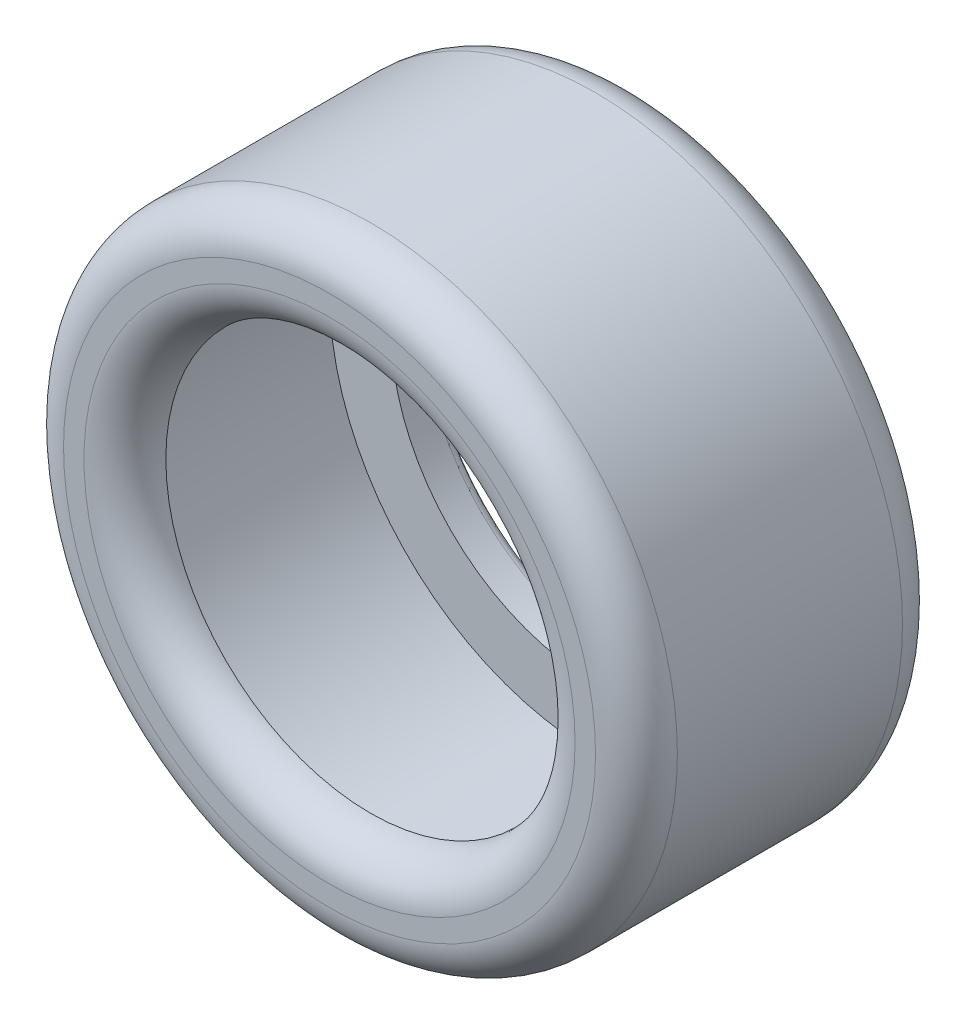
ISO-10303-21;
HEADER;
FILE_DESCRIPTION(('STEP AP214'),'2;1');
FILE_NAME('part.step','',(''),(''),'','','');
FILE_SCHEMA(('AUTOMOTIVE_DESIGN { 1 0 10303 214 1 1 1 1 }'));
ENDSEC;
DATA;
#1=APPLICATION_CONTEXT('core data for automotive mechanical design processes');
#2=APPLICATION_PROTOCOL_DEFINITION('international standard','automotive_design',2000,#1);
#3=PRODUCT_CONTEXT('',#1,'mechanical');
#4=PRODUCT('Part','Part','',(#3));
#5=PRODUCT_RELATED_PRODUCT_CATEGORY('part','',(#4));
#6=PRODUCT_DEFINITION_FORMATION('','',#4);
#7=PRODUCT_DEFINITION_CONTEXT('part definition',#1,'design');
#8=PRODUCT_DEFINITION('design','',#6,#7);
#9=PRODUCT_DEFINITION_SHAPE('','',#8);
#10=(LENGTH_UNIT() NAMED_UNIT(*) SI_UNIT(.MILLI.,.METRE.));
#11=(NAMED_UNIT(*) PLANE_ANGLE_UNIT() SI_UNIT($,.RADIAN.));
#12=(NAMED_UNIT(*) SI_UNIT($,.STERADIAN.) SOLID_ANGLE_UNIT());
#13=UNCERTAINTY_MEASURE_WITH_UNIT(LENGTH_MEASURE(1.E-05),#10,'distance_accuracy_value','');
#14=(GEOMETRIC_REPRESENTATION_CONTEXT(3) GLOBAL_UNCERTAINTY_ASSIGNED_CONTEXT((#13)) GLOBAL_UNIT_ASSIGNED_CONTEXT((#10,
#11,#12)) REPRESENTATION_CONTEXT('',''));
#15=CARTESIAN_POINT('',(0.,0.,0.));
#16=DIRECTION('',(0.,0.,1.));
#17=DIRECTION('',(1.,0.,0.));
#18=AXIS2_PLACEMENT_3D('',#15,#16,#17);
#19=CARTESIAN_POINT('',(0.,0.,15.));
#20=DIRECTION('',(0.,0.,1.));
#21=DIRECTION('',(1.,0.,0.));
#22=AXIS2_PLACEMENT_3D('',#19,#20,#21);
#23=PLANE('',#22);
#24=CARTESIAN_POINT('',(0.,0.,15.));
#25=DIRECTION('',(0.,0.,1.));
#26=DIRECTION('',(1.,0.,0.));
#27=AXIS2_PLACEMENT_3D('',#24,#25,#26);
#28=CIRCLE('',#27,12.);
#29=CARTESIAN_POINT('',(12.,0.,15.));
#30=VERTEX_POINT('',#29);
#31=EDGE_CURVE('E65',#30,#30,#28,.F.);
#32=ORIENTED_EDGE('',*,*,#31,.T.);
#33=EDGE_LOOP('',(#32));
#34=FACE_BOUND('',#33,.T.);
#35=CARTESIAN_POINT('',(0.,0.,15.));
#36=DIRECTION('',(0.,0.,1.));
#37=DIRECTION('',(1.,0.,0.));
#38=AXIS2_PLACEMENT_3D('',#35,#36,#37);
#39=CIRCLE('',#38,13.);
#40=CARTESIAN_POINT('',(13.,0.,15.));
#41=VERTEX_POINT('',#40);
#42=EDGE_CURVE('E68',#41,#41,#39,.T.);
#43=ORIENTED_EDGE('',*,*,#42,.T.);
#44=EDGE_LOOP('',(#43));
#45=FACE_BOUND('',#44,.T.);
#46=ADVANCED_FACE('F42',(#34,#45),#23,.T.);
#47=CARTESIAN_POINT('',(0.,0.,0.));
#48=DIRECTION('',(0.,0.,1.));
#49=DIRECTION('',(1.,0.,0.));
#50=AXIS2_PLACEMENT_3D('',#47,#48,#49);
#51=PLANE('',#50);
#52=CARTESIAN_POINT('',(0.,0.,0.));
#53=DIRECTION('',(0.,0.,1.));
#54=DIRECTION('',(1.,0.,0.));
#55=AXIS2_PLACEMENT_3D('',#52,#53,#54);
#56=CIRCLE('',#55,10.5);
#57=CARTESIAN_POINT('',(10.5,0.,0.));
#58=VERTEX_POINT('',#57);
#59=EDGE_CURVE('E49',#58,#58,#56,.T.);
#60=ORIENTED_EDGE('',*,*,#59,.T.);
#61=EDGE_LOOP('',(#60));
#62=FACE_BOUND('',#61,.T.);
#63=CARTESIAN_POINT('',(0.,0.,0.));
#64=DIRECTION('',(0.,0.,1.));
#65=DIRECTION('',(1.,0.,0.));
#66=AXIS2_PLACEMENT_3D('',#63,#64,#65);
#67=CIRCLE('',#66,13.);
#68=CARTESIAN_POINT('',(13.,0.,0.));
#69=VERTEX_POINT('',#68);
#70=EDGE_CURVE('E53',#69,#69,#67,.F.);
#71=ORIENTED_EDGE('',*,*,#70,.T.);
#72=EDGE_LOOP('',(#71));
#73=FACE_BOUND('',#72,.T.);
#74=ADVANCED_FACE('F98',(#62,#73),#51,.F.);
#75=CARTESIAN_POINT('',(0.,0.,15.));
#76=DIRECTION('',(0.,0.,-1.));
#77=DIRECTION('',(-1.,0.,0.));
#78=AXIS2_PLACEMENT_3D('',#75,#76,#77);
#79=CYLINDRICAL_SURFACE('',#78,15.);
#80=CARTESIAN_POINT('',(0.,0.,13.));
#81=DIRECTION('',(0.,0.,1.));
#82=DIRECTION('',(1.,0.,0.));
#83=AXIS2_PLACEMENT_3D('',#80,#81,#82);
#84=CIRCLE('',#83,15.);
#85=CARTESIAN_POINT('',(15.,0.,13.));
#86=VERTEX_POINT('',#85);
#87=EDGE_CURVE('E57',#86,#86,#84,.F.);
#88=ORIENTED_EDGE('',*,*,#87,.T.);
#89=EDGE_LOOP('',(#88));
#90=FACE_BOUND('',#89,.T.);
#91=CARTESIAN_POINT('',(0.,0.,2.));
#92=DIRECTION('',(0.,0.,1.));
#93=DIRECTION('',(1.,0.,0.));
#94=AXIS2_PLACEMENT_3D('',#91,#92,#93);
#95=CIRCLE('',#94,15.);
#96=CARTESIAN_POINT('',(15.,0.,2.));
#97=VERTEX_POINT('',#96);
#98=EDGE_CURVE('E62',#97,#97,#95,.T.);
#99=ORIENTED_EDGE('',*,*,#98,.T.);
#100=EDGE_LOOP('',(#99));
#101=FACE_BOUND('',#100,.T.);
#102=ADVANCED_FACE('F104',(#90,#101),#79,.T.);
#103=CARTESIAN_POINT('',(0.,0.,15.));
#104=DIRECTION('',(0.,0.,-1.));
#105=DIRECTION('',(-1.,0.,0.));
#106=AXIS2_PLACEMENT_3D('',#103,#104,#105);
#107=CYLINDRICAL_SURFACE('',#106,10.);
#108=CARTESIAN_POINT('',(0.,0.,2.));
#109=DIRECTION('',(0.,0.,1.));
#110=DIRECTION('',(1.,0.,0.));
#111=AXIS2_PLACEMENT_3D('',#108,#109,#110);
#112=CIRCLE('',#111,10.);
#113=CARTESIAN_POINT('',(10.,0.,2.));
#114=VERTEX_POINT('',#113);
#115=EDGE_CURVE('E72',#114,#114,#112,.F.);
#116=ORIENTED_EDGE('',*,*,#115,.F.);
#117=EDGE_LOOP('',(#116));
#118=FACE_BOUND('',#117,.T.);
#119=CARTESIAN_POINT('',(0.,0.,0.5));
#120=DIRECTION('',(0.,0.,1.));
#121=DIRECTION('',(1.,0.,0.));
#122=AXIS2_PLACEMENT_3D('',#119,#120,#121);
#123=CIRCLE('',#122,10.);
#124=CARTESIAN_POINT('',(10.,0.,0.5));
#125=VERTEX_POINT('',#124);
#126=EDGE_CURVE('E11',#125,#125,#123,.F.);
#127=ORIENTED_EDGE('',*,*,#126,.T.);
#128=EDGE_LOOP('',(#127));
#129=FACE_BOUND('',#128,.T.);
#130=ADVANCED_FACE('F107',(#118,#129),#107,.F.);
#131=CARTESIAN_POINT('',(0.,0.,13.));
#132=DIRECTION('',(0.,0.,1.));
#133=DIRECTION('',(1.,0.,0.));
#134=AXIS2_PLACEMENT_3D('',#131,#132,#133);
#135=TOROIDAL_SURFACE('',#134,12.,2.);
#136=ORIENTED_EDGE('',*,*,#31,.F.);
#137=EDGE_LOOP('',(#136));
#138=FACE_BOUND('',#137,.T.);
#139=CARTESIAN_POINT('',(0.,0.,13.));
#140=DIRECTION('',(0.,0.,1.));
#141=DIRECTION('',(1.,0.,0.));
#142=AXIS2_PLACEMENT_3D('',#139,#140,#141);
#143=CIRCLE('',#142,10.);
#144=CARTESIAN_POINT('',(10.,0.,13.));
#145=VERTEX_POINT('',#144);
#146=EDGE_CURVE('E71',#145,#145,#143,.F.);
#147=ORIENTED_EDGE('',*,*,#146,.T.);
#148=EDGE_LOOP('',(#147));
#149=FACE_BOUND('',#148,.T.);
#150=ADVANCED_FACE('F112',(#138,#149),#135,.T.);
#151=CARTESIAN_POINT('',(0.,0.,13.));
#152=DIRECTION('',(0.,0.,1.));
#153=DIRECTION('',(1.,0.,0.));
#154=AXIS2_PLACEMENT_3D('',#151,#152,#153);
#155=TOROIDAL_SURFACE('',#154,13.,2.);
#156=ORIENTED_EDGE('',*,*,#87,.F.);
#157=EDGE_LOOP('',(#156));
#158=FACE_BOUND('',#157,.T.);
#159=ORIENTED_EDGE('',*,*,#42,.F.);
#160=EDGE_LOOP('',(#159));
#161=FACE_BOUND('',#160,.T.);
#162=ADVANCED_FACE('F115',(#158,#161),#155,.T.);
#163=CARTESIAN_POINT('',(0.,0.,2.));
#164=DIRECTION('',(0.,0.,1.));
#165=DIRECTION('',(1.,0.,0.));
#166=AXIS2_PLACEMENT_3D('',#163,#164,#165);
#167=TOROIDAL_SURFACE('',#166,13.,2.);
#168=ORIENTED_EDGE('',*,*,#70,.F.);
#169=EDGE_LOOP('',(#168));
#170=FACE_BOUND('',#169,.T.);
#171=ORIENTED_EDGE('',*,*,#98,.F.);
#172=EDGE_LOOP('',(#171));
#173=FACE_BOUND('',#172,.T.);
#174=ADVANCED_FACE('F118',(#170,#173),#167,.T.);
#175=CARTESIAN_POINT('',(0.,0.,0.5));
#176=DIRECTION('',(0.,0.,1.));
#177=DIRECTION('',(1.,0.,0.));
#178=AXIS2_PLACEMENT_3D('',#175,#176,#177);
#179=TOROIDAL_SURFACE('',#178,10.5,0.5);
#180=ORIENTED_EDGE('',*,*,#126,.F.);
#181=EDGE_LOOP('',(#180));
#182=FACE_BOUND('',#181,.T.);
#183=ORIENTED_EDGE('',*,*,#59,.F.);
#184=EDGE_LOOP('',(#183));
#185=FACE_BOUND('',#184,.T.);
#186=ADVANCED_FACE('F44',(#182,#185),#179,.T.);
#187=CARTESIAN_POINT('',(0.,0.,13.));
#188=DIRECTION('',(0.,0.,1.));
#189=DIRECTION('',(1.,0.,0.));
#190=AXIS2_PLACEMENT_3D('',#187,#188,#189);
#191=PLANE('',#190);
#192=ORIENTED_EDGE('',*,*,#146,.F.);
#193=EDGE_LOOP('',(#192));
#194=FACE_BOUND('',#193,.T.);
#195=CARTESIAN_POINT('',(0.,0.,13.));
#196=DIRECTION('',(0.,0.,1.));
#197=DIRECTION('',(1.,0.,0.));
#198=AXIS2_PLACEMENT_3D('',#195,#196,#197);
#199=CIRCLE('',#198,13.);
#200=CARTESIAN_POINT('',(13.,0.,13.));
#201=VERTEX_POINT('',#200);
#202=EDGE_CURVE('E80',#201,#201,#199,.F.);
#203=ORIENTED_EDGE('',*,*,#202,.T.);
#204=EDGE_LOOP('',(#203));
#205=FACE_BOUND('',#204,.T.);
#206=ADVANCED_FACE('F84',(#194,#205),#191,.F.);
#207=CARTESIAN_POINT('',(0.,0.,2.));
#208=DIRECTION('',(0.,0.,1.));
#209=DIRECTION('',(1.,0.,0.));
#210=AXIS2_PLACEMENT_3D('',#207,#208,#209);
#211=PLANE('',#210);
#212=ORIENTED_EDGE('',*,*,#115,.T.);
#213=EDGE_LOOP('',(#212));
#214=FACE_BOUND('',#213,.T.);
#215=CARTESIAN_POINT('',(0.,0.,2.));
#216=DIRECTION('',(0.,0.,1.));
#217=DIRECTION('',(1.,0.,0.));
#218=AXIS2_PLACEMENT_3D('',#215,#216,#217);
#219=CIRCLE('',#218,13.);
#220=CARTESIAN_POINT('',(13.,0.,2.));
#221=VERTEX_POINT('',#220);
#222=EDGE_CURVE('E75',#221,#221,#219,.F.);
#223=ORIENTED_EDGE('',*,*,#222,.F.);
#224=EDGE_LOOP('',(#223));
#225=FACE_BOUND('',#224,.T.);
#226=ADVANCED_FACE('F88',(#214,#225),#211,.T.);
#227=CARTESIAN_POINT('',(0.,0.,15.));
#228=DIRECTION('',(0.,0.,-1.));
#229=DIRECTION('',(-1.,0.,0.));
#230=AXIS2_PLACEMENT_3D('',#227,#228,#229);
#231=CYLINDRICAL_SURFACE('',#230,13.);
#232=ORIENTED_EDGE('',*,*,#222,.T.);
#233=EDGE_LOOP('',(#232));
#234=FACE_BOUND('',#233,.T.);
#235=ORIENTED_EDGE('',*,*,#202,.F.);
#236=EDGE_LOOP('',(#235));
#237=FACE_BOUND('',#236,.T.);
#238=ADVANCED_FACE('F86',(#234,#237),#231,.F.);
#239=CLOSED_SHELL('',(#46,#74,#102,#130,#150,#162,#174,#186,#206,#226,#238));
#240=MANIFOLD_SOLID_BREP('B2',#239);
#241=ADVANCED_BREP_SHAPE_REPRESENTATION('',(#18,#240),#14);
#242=SHAPE_DEFINITION_REPRESENTATION(#9,#241);
ENDSEC;
END-ISO-10303-21;
